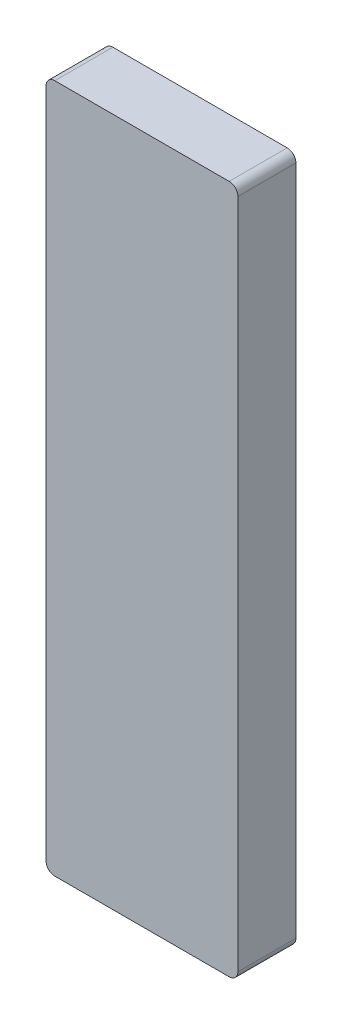
ISO-10303-21;
HEADER;
FILE_DESCRIPTION(('STEP AP214'),'2;1');
FILE_NAME('part.step','',(''),(''),'','','');
FILE_SCHEMA(('AUTOMOTIVE_DESIGN { 1 0 10303 214 1 1 1 1 }'));
ENDSEC;
DATA;
#1=APPLICATION_CONTEXT('core data for automotive mechanical design processes');
#2=APPLICATION_PROTOCOL_DEFINITION('international standard','automotive_design',2000,#1);
#3=PRODUCT_CONTEXT('',#1,'mechanical');
#4=PRODUCT('Part','Part','',(#3));
#5=PRODUCT_RELATED_PRODUCT_CATEGORY('part','',(#4));
#6=PRODUCT_DEFINITION_FORMATION('','',#4);
#7=PRODUCT_DEFINITION_CONTEXT('part definition',#1,'design');
#8=PRODUCT_DEFINITION('design','',#6,#7);
#9=PRODUCT_DEFINITION_SHAPE('','',#8);
#10=(LENGTH_UNIT() NAMED_UNIT(*) SI_UNIT(.MILLI.,.METRE.));
#11=(NAMED_UNIT(*) PLANE_ANGLE_UNIT() SI_UNIT($,.RADIAN.));
#12=(NAMED_UNIT(*) SI_UNIT($,.STERADIAN.) SOLID_ANGLE_UNIT());
#13=UNCERTAINTY_MEASURE_WITH_UNIT(LENGTH_MEASURE(1.E-05),#10,'distance_accuracy_value','');
#14=(GEOMETRIC_REPRESENTATION_CONTEXT(3) GLOBAL_UNCERTAINTY_ASSIGNED_CONTEXT((#13)) GLOBAL_UNIT_ASSIGNED_CONTEXT((#10,
#11,#12)) REPRESENTATION_CONTEXT('',''));
#15=CARTESIAN_POINT('',(0.,0.,0.));
#16=DIRECTION('',(0.,0.,1.));
#17=DIRECTION('',(1.,0.,0.));
#18=AXIS2_PLACEMENT_3D('',#15,#16,#17);
#19=CARTESIAN_POINT('',(25.4000000000002,-1981.2,169.05));
#20=DIRECTION('',(0.,0.,-1.));
#21=DIRECTION('',(-1.,0.,0.));
#22=AXIS2_PLACEMENT_3D('',#19,#20,#21);
#23=CYLINDRICAL_SURFACE('',#22,25.4);
#24=CARTESIAN_POINT('',(25.4000000000002,-1981.2,0.));
#25=DIRECTION('',(0.,0.,1.));
#26=DIRECTION('',(1.,0.,0.));
#27=AXIS2_PLACEMENT_3D('',#24,#25,#26);
#28=CIRCLE('',#27,25.4);
#29=CARTESIAN_POINT('',(2.39391839684799E-13,-1981.2,0.));
#30=VERTEX_POINT('',#29);
#31=CARTESIAN_POINT('',(25.4000000000002,-2006.6,0.));
#32=VERTEX_POINT('',#31);
#33=EDGE_CURVE('E128',#30,#32,#28,.T.);
#34=ORIENTED_EDGE('',*,*,#33,.T.);
#35=DIRECTION('',(0.,0.,-1.));
#36=VECTOR('',#35,1.);
#37=CARTESIAN_POINT('',(25.4000000000002,-2006.6,169.05));
#38=LINE('',#37,#36);
#39=CARTESIAN_POINT('',(25.4000000000002,-2006.6,169.05));
#40=VERTEX_POINT('',#39);
#41=EDGE_CURVE('E11',#40,#32,#38,.T.);
#42=ORIENTED_EDGE('',*,*,#41,.F.);
#43=CARTESIAN_POINT('',(25.4000000000002,-1981.2,169.05));
#44=DIRECTION('',(0.,0.,1.));
#45=DIRECTION('',(1.,0.,0.));
#46=AXIS2_PLACEMENT_3D('',#43,#44,#45);
#47=CIRCLE('',#46,25.4);
#48=CARTESIAN_POINT('',(2.39391839684799E-13,-1981.2,169.05));
#49=VERTEX_POINT('',#48);
#50=EDGE_CURVE('E142',#49,#40,#47,.T.);
#51=ORIENTED_EDGE('',*,*,#50,.F.);
#52=DIRECTION('',(0.,0.,-1.));
#53=VECTOR('',#52,1.);
#54=CARTESIAN_POINT('',(2.39391839684799E-13,-1981.2,169.05));
#55=LINE('',#54,#53);
#56=EDGE_CURVE('E124',#49,#30,#55,.T.);
#57=ORIENTED_EDGE('',*,*,#56,.T.);
#58=EDGE_LOOP('',(#34,#42,#51,#57));
#59=FACE_BOUND('',#58,.T.);
#60=ADVANCED_FACE('F32',(#59),#23,.T.);
#61=CARTESIAN_POINT('',(25.4000000000002,-2006.6,169.05));
#62=DIRECTION('',(0.,1.,0.));
#63=DIRECTION('',(0.,0.,1.));
#64=AXIS2_PLACEMENT_3D('',#61,#62,#63);
#65=PLANE('',#64);
#66=DIRECTION('',(1.,0.,0.));
#67=VECTOR('',#66,1.);
#68=CARTESIAN_POINT('',(25.4000000000002,-2006.6,0.));
#69=LINE('',#68,#67);
#70=CARTESIAN_POINT('',(533.4,-2006.6,0.));
#71=VERTEX_POINT('',#70);
#72=EDGE_CURVE('E131',#32,#71,#69,.T.);
#73=ORIENTED_EDGE('',*,*,#72,.T.);
#74=DIRECTION('',(0.,0.,-1.));
#75=VECTOR('',#74,1.);
#76=CARTESIAN_POINT('',(533.4,-2006.6,169.05));
#77=LINE('',#76,#75);
#78=CARTESIAN_POINT('',(533.4,-2006.6,169.05));
#79=VERTEX_POINT('',#78);
#80=EDGE_CURVE('E40',#79,#71,#77,.T.);
#81=ORIENTED_EDGE('',*,*,#80,.F.);
#82=DIRECTION('',(1.,0.,0.));
#83=VECTOR('',#82,1.);
#84=CARTESIAN_POINT('',(25.4000000000002,-2006.6,169.05));
#85=LINE('',#84,#83);
#86=EDGE_CURVE('E91',#40,#79,#85,.T.);
#87=ORIENTED_EDGE('',*,*,#86,.F.);
#88=ORIENTED_EDGE('',*,*,#41,.T.);
#89=EDGE_LOOP('',(#73,#81,#87,#88));
#90=FACE_BOUND('',#89,.T.);
#91=ADVANCED_FACE('F177',(#90),#65,.F.);
#92=CARTESIAN_POINT('',(533.4,-1981.2,169.05));
#93=DIRECTION('',(0.,0.,-1.));
#94=DIRECTION('',(-1.,0.,0.));
#95=AXIS2_PLACEMENT_3D('',#92,#93,#94);
#96=CYLINDRICAL_SURFACE('',#95,25.4);
#97=CARTESIAN_POINT('',(533.4,-1981.2,0.));
#98=DIRECTION('',(0.,0.,1.));
#99=DIRECTION('',(1.,0.,0.));
#100=AXIS2_PLACEMENT_3D('',#97,#98,#99);
#101=CIRCLE('',#100,25.4);
#102=CARTESIAN_POINT('',(558.8,-1981.2,0.));
#103=VERTEX_POINT('',#102);
#104=EDGE_CURVE('E133',#71,#103,#101,.T.);
#105=ORIENTED_EDGE('',*,*,#104,.T.);
#106=DIRECTION('',(0.,0.,-1.));
#107=VECTOR('',#106,1.);
#108=CARTESIAN_POINT('',(558.8,-1981.2,169.05));
#109=LINE('',#108,#107);
#110=CARTESIAN_POINT('',(558.8,-1981.2,169.05));
#111=VERTEX_POINT('',#110);
#112=EDGE_CURVE('E149',#111,#103,#109,.T.);
#113=ORIENTED_EDGE('',*,*,#112,.F.);
#114=CARTESIAN_POINT('',(533.4,-1981.2,169.05));
#115=DIRECTION('',(0.,0.,1.));
#116=DIRECTION('',(1.,0.,0.));
#117=AXIS2_PLACEMENT_3D('',#114,#115,#116);
#118=CIRCLE('',#117,25.4);
#119=EDGE_CURVE('E157',#79,#111,#118,.T.);
#120=ORIENTED_EDGE('',*,*,#119,.F.);
#121=ORIENTED_EDGE('',*,*,#80,.T.);
#122=EDGE_LOOP('',(#105,#113,#120,#121));
#123=FACE_BOUND('',#122,.T.);
#124=ADVANCED_FACE('F155',(#123),#96,.T.);
#125=CARTESIAN_POINT('',(558.8,-25.4,169.05));
#126=DIRECTION('',(-1.,0.,0.));
#127=DIRECTION('',(0.,-1.,0.));
#128=AXIS2_PLACEMENT_3D('',#125,#126,#127);
#129=PLANE('',#128);
#130=DIRECTION('',(0.,1.,0.));
#131=VECTOR('',#130,1.);
#132=CARTESIAN_POINT('',(558.8,-25.4,0.));
#133=LINE('',#132,#131);
#134=CARTESIAN_POINT('',(558.8,-25.4,0.));
#135=VERTEX_POINT('',#134);
#136=EDGE_CURVE('E135',#103,#135,#133,.T.);
#137=ORIENTED_EDGE('',*,*,#136,.T.);
#138=DIRECTION('',(0.,0.,-1.));
#139=VECTOR('',#138,1.);
#140=CARTESIAN_POINT('',(558.8,-25.4,169.05));
#141=LINE('',#140,#139);
#142=CARTESIAN_POINT('',(558.8,-25.4,169.05));
#143=VERTEX_POINT('',#142);
#144=EDGE_CURVE('E146',#143,#135,#141,.T.);
#145=ORIENTED_EDGE('',*,*,#144,.F.);
#146=DIRECTION('',(0.,1.,0.));
#147=VECTOR('',#146,1.);
#148=CARTESIAN_POINT('',(558.8,-25.4,169.05));
#149=LINE('',#148,#147);
#150=EDGE_CURVE('E169',#111,#143,#149,.T.);
#151=ORIENTED_EDGE('',*,*,#150,.F.);
#152=ORIENTED_EDGE('',*,*,#112,.T.);
#153=EDGE_LOOP('',(#137,#145,#151,#152));
#154=FACE_BOUND('',#153,.T.);
#155=ADVANCED_FACE('F165',(#154),#129,.F.);
#156=CARTESIAN_POINT('',(533.4,-25.4,169.05));
#157=DIRECTION('',(0.,0.,-1.));
#158=DIRECTION('',(-1.,0.,0.));
#159=AXIS2_PLACEMENT_3D('',#156,#157,#158);
#160=CYLINDRICAL_SURFACE('',#159,25.4);
#161=CARTESIAN_POINT('',(533.4,-25.4,0.));
#162=DIRECTION('',(0.,0.,1.));
#163=DIRECTION('',(-1.,0.,0.));
#164=AXIS2_PLACEMENT_3D('',#161,#162,#163);
#165=CIRCLE('',#164,25.4);
#166=CARTESIAN_POINT('',(533.4,0.,0.));
#167=VERTEX_POINT('',#166);
#168=EDGE_CURVE('E137',#135,#167,#165,.T.);
#169=ORIENTED_EDGE('',*,*,#168,.T.);
#170=DIRECTION('',(0.,0.,-1.));
#171=VECTOR('',#170,1.);
#172=CARTESIAN_POINT('',(533.4,0.,169.05));
#173=LINE('',#172,#171);
#174=CARTESIAN_POINT('',(533.4,0.,169.05));
#175=VERTEX_POINT('',#174);
#176=EDGE_CURVE('E119',#175,#167,#173,.T.);
#177=ORIENTED_EDGE('',*,*,#176,.F.);
#178=CARTESIAN_POINT('',(533.4,-25.4,169.05));
#179=DIRECTION('',(0.,0.,1.));
#180=DIRECTION('',(-1.,0.,0.));
#181=AXIS2_PLACEMENT_3D('',#178,#179,#180);
#182=CIRCLE('',#181,25.4);
#183=EDGE_CURVE('E110',#143,#175,#182,.T.);
#184=ORIENTED_EDGE('',*,*,#183,.F.);
#185=ORIENTED_EDGE('',*,*,#144,.T.);
#186=EDGE_LOOP('',(#169,#177,#184,#185));
#187=FACE_BOUND('',#186,.T.);
#188=ADVANCED_FACE('F168',(#187),#160,.T.);
#189=CARTESIAN_POINT('',(25.4000000000002,0.,169.05));
#190=DIRECTION('',(0.,-1.,0.));
#191=DIRECTION('',(0.,0.,-1.));
#192=AXIS2_PLACEMENT_3D('',#189,#190,#191);
#193=PLANE('',#192);
#194=DIRECTION('',(-1.,0.,0.));
#195=VECTOR('',#194,1.);
#196=CARTESIAN_POINT('',(25.4000000000002,0.,0.));
#197=LINE('',#196,#195);
#198=CARTESIAN_POINT('',(25.4000000000002,0.,0.));
#199=VERTEX_POINT('',#198);
#200=EDGE_CURVE('E118',#167,#199,#197,.T.);
#201=ORIENTED_EDGE('',*,*,#200,.T.);
#202=DIRECTION('',(0.,0.,-1.));
#203=VECTOR('',#202,1.);
#204=CARTESIAN_POINT('',(25.4000000000002,0.,169.05));
#205=LINE('',#204,#203);
#206=CARTESIAN_POINT('',(25.4000000000002,0.,169.05));
#207=VERTEX_POINT('',#206);
#208=EDGE_CURVE('E115',#207,#199,#205,.T.);
#209=ORIENTED_EDGE('',*,*,#208,.F.);
#210=DIRECTION('',(-1.,0.,0.));
#211=VECTOR('',#210,1.);
#212=CARTESIAN_POINT('',(25.4000000000002,0.,169.05));
#213=LINE('',#212,#211);
#214=EDGE_CURVE('E104',#175,#207,#213,.T.);
#215=ORIENTED_EDGE('',*,*,#214,.F.);
#216=ORIENTED_EDGE('',*,*,#176,.T.);
#217=EDGE_LOOP('',(#201,#209,#215,#216));
#218=FACE_BOUND('',#217,.T.);
#219=ADVANCED_FACE('F116',(#218),#193,.F.);
#220=CARTESIAN_POINT('',(25.4,-25.4,169.05));
#221=DIRECTION('',(0.,0.,-1.));
#222=DIRECTION('',(-1.,0.,0.));
#223=AXIS2_PLACEMENT_3D('',#220,#221,#222);
#224=CYLINDRICAL_SURFACE('',#223,25.4);
#225=CARTESIAN_POINT('',(25.4,-25.4,0.));
#226=DIRECTION('',(0.,0.,1.));
#227=DIRECTION('',(1.,0.,0.));
#228=AXIS2_PLACEMENT_3D('',#225,#226,#227);
#229=CIRCLE('',#228,25.4);
#230=CARTESIAN_POINT('',(0.,-25.4000000000002,0.));
#231=VERTEX_POINT('',#230);
#232=EDGE_CURVE('E77',#199,#231,#229,.T.);
#233=ORIENTED_EDGE('',*,*,#232,.T.);
#234=DIRECTION('',(0.,0.,-1.));
#235=VECTOR('',#234,1.);
#236=CARTESIAN_POINT('',(0.,-25.4000000000002,169.05));
#237=LINE('',#236,#235);
#238=CARTESIAN_POINT('',(0.,-25.4000000000002,169.05));
#239=VERTEX_POINT('',#238);
#240=EDGE_CURVE('E120',#239,#231,#237,.T.);
#241=ORIENTED_EDGE('',*,*,#240,.F.);
#242=CARTESIAN_POINT('',(25.4,-25.4,169.05));
#243=DIRECTION('',(0.,0.,1.));
#244=DIRECTION('',(1.,0.,0.));
#245=AXIS2_PLACEMENT_3D('',#242,#243,#244);
#246=CIRCLE('',#245,25.4);
#247=EDGE_CURVE('E108',#207,#239,#246,.T.);
#248=ORIENTED_EDGE('',*,*,#247,.F.);
#249=ORIENTED_EDGE('',*,*,#208,.T.);
#250=EDGE_LOOP('',(#233,#241,#248,#249));
#251=FACE_BOUND('',#250,.T.);
#252=ADVANCED_FACE('F122',(#251),#224,.T.);
#253=CARTESIAN_POINT('',(0.,-25.4000000000002,169.05));
#254=DIRECTION('',(1.,0.,0.));
#255=DIRECTION('',(0.,1.,0.));
#256=AXIS2_PLACEMENT_3D('',#253,#254,#255);
#257=PLANE('',#256);
#258=DIRECTION('',(0.,-1.,0.));
#259=VECTOR('',#258,1.);
#260=CARTESIAN_POINT('',(0.,-25.4000000000002,0.));
#261=LINE('',#260,#259);
#262=EDGE_CURVE('E83',#231,#30,#261,.T.);
#263=ORIENTED_EDGE('',*,*,#262,.T.);
#264=ORIENTED_EDGE('',*,*,#56,.F.);
#265=DIRECTION('',(0.,-1.,0.));
#266=VECTOR('',#265,1.);
#267=CARTESIAN_POINT('',(0.,-25.4000000000002,169.05));
#268=LINE('',#267,#266);
#269=EDGE_CURVE('E48',#239,#49,#268,.T.);
#270=ORIENTED_EDGE('',*,*,#269,.F.);
#271=ORIENTED_EDGE('',*,*,#240,.T.);
#272=EDGE_LOOP('',(#263,#264,#270,#271));
#273=FACE_BOUND('',#272,.T.);
#274=ADVANCED_FACE('F193',(#273),#257,.F.);
#275=CARTESIAN_POINT('',(25.4000000000002,-1981.2,169.05));
#276=DIRECTION('',(0.,0.,1.));
#277=DIRECTION('',(1.,0.,0.));
#278=AXIS2_PLACEMENT_3D('',#275,#276,#277);
#279=PLANE('',#278);
#280=ORIENTED_EDGE('',*,*,#50,.T.);
#281=ORIENTED_EDGE('',*,*,#86,.T.);
#282=ORIENTED_EDGE('',*,*,#119,.T.);
#283=ORIENTED_EDGE('',*,*,#150,.T.);
#284=ORIENTED_EDGE('',*,*,#183,.T.);
#285=ORIENTED_EDGE('',*,*,#214,.T.);
#286=ORIENTED_EDGE('',*,*,#247,.T.);
#287=ORIENTED_EDGE('',*,*,#269,.T.);
#288=EDGE_LOOP('',(#280,#281,#282,#283,#284,#285,#286,#287));
#289=FACE_BOUND('',#288,.T.);
#290=ADVANCED_FACE('F106',(#289),#279,.T.);
#291=CARTESIAN_POINT('',(25.4000000000002,-1981.2,0.));
#292=DIRECTION('',(0.,0.,1.));
#293=DIRECTION('',(1.,0.,0.));
#294=AXIS2_PLACEMENT_3D('',#291,#292,#293);
#295=PLANE('',#294);
#296=ORIENTED_EDGE('',*,*,#33,.F.);
#297=ORIENTED_EDGE('',*,*,#262,.F.);
#298=ORIENTED_EDGE('',*,*,#232,.F.);
#299=ORIENTED_EDGE('',*,*,#200,.F.);
#300=ORIENTED_EDGE('',*,*,#168,.F.);
#301=ORIENTED_EDGE('',*,*,#136,.F.);
#302=ORIENTED_EDGE('',*,*,#104,.F.);
#303=ORIENTED_EDGE('',*,*,#72,.F.);
#304=EDGE_LOOP('',(#296,#297,#298,#299,#300,#301,#302,#303));
#305=FACE_BOUND('',#304,.T.);
#306=ADVANCED_FACE('F161',(#305),#295,.F.);
#307=CLOSED_SHELL('',(#60,#91,#124,#155,#188,#219,#252,#274,#290,#306));
#308=MANIFOLD_SOLID_BREP('B2',#307);
#309=ADVANCED_BREP_SHAPE_REPRESENTATION('',(#18,#308),#14);
#310=SHAPE_DEFINITION_REPRESENTATION(#9,#309);
ENDSEC;
END-ISO-10303-21;
